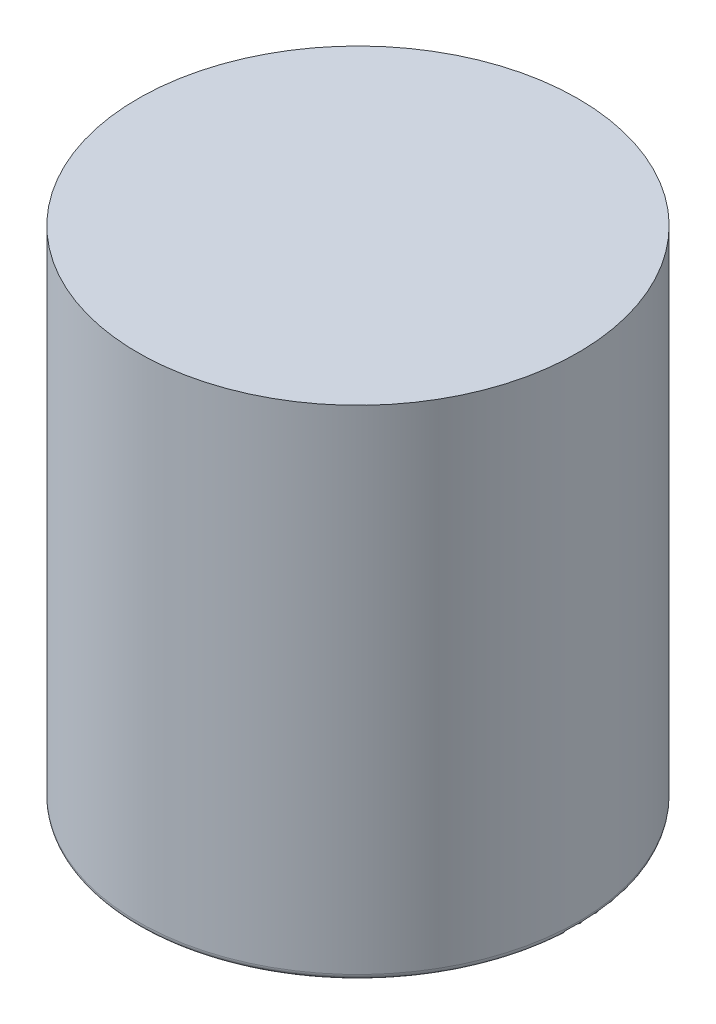
ISO-10303-21;
HEADER;
FILE_DESCRIPTION(('STEP AP214'),'2;1');
FILE_NAME('part.step','',(''),(''),'','','');
FILE_SCHEMA(('AUTOMOTIVE_DESIGN { 1 0 10303 214 1 1 1 1 }'));
ENDSEC;
DATA;
#1=APPLICATION_CONTEXT('core data for automotive mechanical design processes');
#2=APPLICATION_PROTOCOL_DEFINITION('international standard','automotive_design',2000,#1);
#3=PRODUCT_CONTEXT('',#1,'mechanical');
#4=PRODUCT('Part','Part','',(#3));
#5=PRODUCT_RELATED_PRODUCT_CATEGORY('part','',(#4));
#6=PRODUCT_DEFINITION_FORMATION('','',#4);
#7=PRODUCT_DEFINITION_CONTEXT('part definition',#1,'design');
#8=PRODUCT_DEFINITION('design','',#6,#7);
#9=PRODUCT_DEFINITION_SHAPE('','',#8);
#10=(LENGTH_UNIT() NAMED_UNIT(*) SI_UNIT(.MILLI.,.METRE.));
#11=(NAMED_UNIT(*) PLANE_ANGLE_UNIT() SI_UNIT($,.RADIAN.));
#12=(NAMED_UNIT(*) SI_UNIT($,.STERADIAN.) SOLID_ANGLE_UNIT());
#13=UNCERTAINTY_MEASURE_WITH_UNIT(LENGTH_MEASURE(1.E-05),#10,'distance_accuracy_value','');
#14=(GEOMETRIC_REPRESENTATION_CONTEXT(3) GLOBAL_UNCERTAINTY_ASSIGNED_CONTEXT((#13)) GLOBAL_UNIT_ASSIGNED_CONTEXT((#10,
#11,#12)) REPRESENTATION_CONTEXT('',''));
#15=CARTESIAN_POINT('',(0.,0.,0.));
#16=DIRECTION('',(0.,0.,1.));
#17=DIRECTION('',(1.,0.,0.));
#18=AXIS2_PLACEMENT_3D('',#15,#16,#17);
#19=CARTESIAN_POINT('',(7.5,5.90047393364929,0.));
#20=DIRECTION('',(0.,1.,0.));
#21=DIRECTION('',(0.,0.,1.));
#22=AXIS2_PLACEMENT_3D('',#19,#20,#21);
#23=PLANE('',#22);
#24=CARTESIAN_POINT('',(0.,5.90047393364929,0.));
#25=DIRECTION('',(0.,-1.,0.));
#26=DIRECTION('',(0.,0.,-1.));
#27=AXIS2_PLACEMENT_3D('',#24,#25,#26);
#28=CIRCLE('',#27,7.5);
#29=CARTESIAN_POINT('',(0.,5.90047393364929,-7.5));
#30=VERTEX_POINT('',#29);
#31=EDGE_CURVE('E45',#30,#30,#28,.T.);
#32=ORIENTED_EDGE('',*,*,#31,.F.);
#33=EDGE_LOOP('',(#32));
#34=FACE_BOUND('',#33,.T.);
#35=ADVANCED_FACE('F34',(#34),#23,.T.);
#36=CARTESIAN_POINT('',(0.,-19.8403774924026,0.));
#37=DIRECTION('',(0.,-1.,0.));
#38=DIRECTION('',(0.,0.,-1.));
#39=AXIS2_PLACEMENT_3D('',#36,#37,#38);
#40=CYLINDRICAL_SURFACE('',#39,7.5);
#41=CARTESIAN_POINT('',(0.,-10.8995260663507,0.));
#42=DIRECTION('',(0.,-1.,0.));
#43=DIRECTION('',(0.,0.,-1.));
#44=AXIS2_PLACEMENT_3D('',#41,#42,#43);
#45=CIRCLE('',#44,7.5);
#46=CARTESIAN_POINT('',(0.,-10.8995260663507,-7.5));
#47=VERTEX_POINT('',#46);
#48=EDGE_CURVE('E10',#47,#47,#45,.F.);
#49=ORIENTED_EDGE('',*,*,#48,.T.);
#50=EDGE_LOOP('',(#49));
#51=FACE_BOUND('',#50,.T.);
#52=ORIENTED_EDGE('',*,*,#31,.T.);
#53=EDGE_LOOP('',(#52));
#54=FACE_BOUND('',#53,.T.);
#55=ADVANCED_FACE('F83',(#51,#54),#40,.T.);
#56=CARTESIAN_POINT('',(3.5,-11.0995260663507,0.));
#57=DIRECTION('',(0.,-1.,0.));
#58=DIRECTION('',(0.,0.,-1.));
#59=AXIS2_PLACEMENT_3D('',#56,#57,#58);
#60=PLANE('',#59);
#61=CARTESIAN_POINT('',(0.,-11.0995260663507,0.));
#62=DIRECTION('',(0.,-1.,0.));
#63=DIRECTION('',(0.,0.,-1.));
#64=AXIS2_PLACEMENT_3D('',#61,#62,#63);
#65=CIRCLE('',#64,7.3);
#66=CARTESIAN_POINT('',(0.,-11.0995260663507,-7.3));
#67=VERTEX_POINT('',#66);
#68=EDGE_CURVE('E41',#67,#67,#65,.T.);
#69=ORIENTED_EDGE('',*,*,#68,.T.);
#70=EDGE_LOOP('',(#69));
#71=FACE_BOUND('',#70,.T.);
#72=CARTESIAN_POINT('',(0.,-11.0995260663507,5.43971342947618));
#73=DIRECTION('',(0.,-1.,0.));
#74=DIRECTION('',(0.,0.,-1.));
#75=AXIS2_PLACEMENT_3D('',#72,#73,#74);
#76=CIRCLE('',#75,0.79999999999999);
#77=CARTESIAN_POINT('',(0.,-11.0995260663507,4.63971342947619));
#78=VERTEX_POINT('',#77);
#79=EDGE_CURVE('E72',#78,#78,#76,.T.);
#80=ORIENTED_EDGE('',*,*,#79,.F.);
#81=EDGE_LOOP('',(#80));
#82=FACE_BOUND('',#81,.T.);
#83=CARTESIAN_POINT('',(0.,-11.0995260663507,-5.43971342947618));
#84=DIRECTION('',(0.,-1.,0.));
#85=DIRECTION('',(0.,0.,-1.));
#86=AXIS2_PLACEMENT_3D('',#83,#84,#85);
#87=CIRCLE('',#86,0.79999999999999);
#88=CARTESIAN_POINT('',(0.,-11.0995260663507,-6.23971342947617));
#89=VERTEX_POINT('',#88);
#90=EDGE_CURVE('E66',#89,#89,#87,.T.);
#91=ORIENTED_EDGE('',*,*,#90,.F.);
#92=EDGE_LOOP('',(#91));
#93=FACE_BOUND('',#92,.T.);
#94=CARTESIAN_POINT('',(0.,-11.0995260663507,0.));
#95=DIRECTION('',(0.,-1.,0.));
#96=DIRECTION('',(0.,0.,-1.));
#97=AXIS2_PLACEMENT_3D('',#94,#95,#96);
#98=CIRCLE('',#97,3.5);
#99=CARTESIAN_POINT('',(0.,-11.0995260663507,-3.5));
#100=VERTEX_POINT('',#99);
#101=EDGE_CURVE('E49',#100,#100,#98,.T.);
#102=ORIENTED_EDGE('',*,*,#101,.F.);
#103=EDGE_LOOP('',(#102));
#104=FACE_BOUND('',#103,.T.);
#105=ADVANCED_FACE('F79',(#71,#82,#93,#104),#60,.T.);
#106=CARTESIAN_POINT('',(0.,-19.8403774924026,0.));
#107=DIRECTION('',(0.,-1.,0.));
#108=DIRECTION('',(0.,0.,-1.));
#109=AXIS2_PLACEMENT_3D('',#106,#107,#108);
#110=CYLINDRICAL_SURFACE('',#109,3.5);
#111=CARTESIAN_POINT('',(0.,-10.4995260663507,0.));
#112=DIRECTION('',(0.,-1.,0.));
#113=DIRECTION('',(0.,0.,-1.));
#114=AXIS2_PLACEMENT_3D('',#111,#112,#113);
#115=CIRCLE('',#114,3.5);
#116=CARTESIAN_POINT('',(0.,-10.4995260663507,-3.5));
#117=VERTEX_POINT('',#116);
#118=EDGE_CURVE('E54',#117,#117,#115,.T.);
#119=ORIENTED_EDGE('',*,*,#118,.F.);
#120=EDGE_LOOP('',(#119));
#121=FACE_BOUND('',#120,.T.);
#122=ORIENTED_EDGE('',*,*,#101,.T.);
#123=EDGE_LOOP('',(#122));
#124=FACE_BOUND('',#123,.T.);
#125=ADVANCED_FACE('F82',(#121,#124),#110,.F.);
#126=CARTESIAN_POINT('',(3.5,-10.4995260663507,0.));
#127=DIRECTION('',(0.,-1.,0.));
#128=DIRECTION('',(0.,0.,-1.));
#129=AXIS2_PLACEMENT_3D('',#126,#127,#128);
#130=PLANE('',#129);
#131=CARTESIAN_POINT('',(0.,-10.4995260663507,5.43971342947618));
#132=DIRECTION('',(0.,-1.,0.));
#133=DIRECTION('',(0.,0.,-1.));
#134=AXIS2_PLACEMENT_3D('',#131,#132,#133);
#135=CIRCLE('',#134,0.799999999999994);
#136=CARTESIAN_POINT('',(0.,-10.4995260663507,4.63971342947618));
#137=VERTEX_POINT('',#136);
#138=EDGE_CURVE('E69',#137,#137,#135,.T.);
#139=ORIENTED_EDGE('',*,*,#138,.T.);
#140=EDGE_LOOP('',(#139));
#141=FACE_BOUND('',#140,.T.);
#142=CARTESIAN_POINT('',(0.,-10.4995260663507,-5.43971342947618));
#143=DIRECTION('',(0.,-1.,0.));
#144=DIRECTION('',(0.,0.,-1.));
#145=AXIS2_PLACEMENT_3D('',#142,#143,#144);
#146=CIRCLE('',#145,0.799999999999994);
#147=CARTESIAN_POINT('',(0.,-10.4995260663507,-6.23971342947617));
#148=VERTEX_POINT('',#147);
#149=EDGE_CURVE('E63',#148,#148,#146,.T.);
#150=ORIENTED_EDGE('',*,*,#149,.T.);
#151=EDGE_LOOP('',(#150));
#152=FACE_BOUND('',#151,.T.);
#153=CARTESIAN_POINT('',(0.,-10.4995260663507,0.));
#154=DIRECTION('',(0.,-1.,0.));
#155=DIRECTION('',(0.,0.,-1.));
#156=AXIS2_PLACEMENT_3D('',#153,#154,#155);
#157=CIRCLE('',#156,6.9);
#158=CARTESIAN_POINT('',(0.,-10.4995260663507,-6.9));
#159=VERTEX_POINT('',#158);
#160=EDGE_CURVE('E57',#159,#159,#157,.T.);
#161=ORIENTED_EDGE('',*,*,#160,.F.);
#162=EDGE_LOOP('',(#161));
#163=FACE_BOUND('',#162,.T.);
#164=ORIENTED_EDGE('',*,*,#118,.T.);
#165=EDGE_LOOP('',(#164));
#166=FACE_BOUND('',#165,.T.);
#167=ADVANCED_FACE('F90',(#141,#152,#163,#166),#130,.F.);
#168=CARTESIAN_POINT('',(0.,-19.8403774924026,0.));
#169=DIRECTION('',(0.,-1.,0.));
#170=DIRECTION('',(0.,0.,-1.));
#171=AXIS2_PLACEMENT_3D('',#168,#169,#170);
#172=CYLINDRICAL_SURFACE('',#171,6.9);
#173=CARTESIAN_POINT('',(0.,5.30047393364929,0.));
#174=DIRECTION('',(0.,-1.,0.));
#175=DIRECTION('',(0.,0.,-1.));
#176=AXIS2_PLACEMENT_3D('',#173,#174,#175);
#177=CIRCLE('',#176,6.9);
#178=CARTESIAN_POINT('',(0.,5.30047393364929,-6.9));
#179=VERTEX_POINT('',#178);
#180=EDGE_CURVE('E60',#179,#179,#177,.T.);
#181=ORIENTED_EDGE('',*,*,#180,.F.);
#182=EDGE_LOOP('',(#181));
#183=FACE_BOUND('',#182,.T.);
#184=ORIENTED_EDGE('',*,*,#160,.T.);
#185=EDGE_LOOP('',(#184));
#186=FACE_BOUND('',#185,.T.);
#187=ADVANCED_FACE('F96',(#183,#186),#172,.F.);
#188=CARTESIAN_POINT('',(7.5,5.30047393364929,0.));
#189=DIRECTION('',(0.,1.,0.));
#190=DIRECTION('',(0.,0.,1.));
#191=AXIS2_PLACEMENT_3D('',#188,#189,#190);
#192=PLANE('',#191);
#193=ORIENTED_EDGE('',*,*,#180,.T.);
#194=EDGE_LOOP('',(#193));
#195=FACE_BOUND('',#194,.T.);
#196=ADVANCED_FACE('F140',(#195),#192,.F.);
#197=CARTESIAN_POINT('',(0.,-11.0995260663507,-5.43971342947618));
#198=DIRECTION('',(0.,-1.,0.));
#199=DIRECTION('',(0.,0.,-1.));
#200=AXIS2_PLACEMENT_3D('',#197,#198,#199);
#201=CYLINDRICAL_SURFACE('',#200,0.799999999999994);
#202=ORIENTED_EDGE('',*,*,#90,.T.);
#203=EDGE_LOOP('',(#202));
#204=FACE_BOUND('',#203,.T.);
#205=ORIENTED_EDGE('',*,*,#149,.F.);
#206=EDGE_LOOP('',(#205));
#207=FACE_BOUND('',#206,.T.);
#208=ADVANCED_FACE('F133',(#204,#207),#201,.F.);
#209=CARTESIAN_POINT('',(0.,-11.0995260663507,5.43971342947618));
#210=DIRECTION('',(0.,-1.,0.));
#211=DIRECTION('',(0.,0.,-1.));
#212=AXIS2_PLACEMENT_3D('',#209,#210,#211);
#213=CYLINDRICAL_SURFACE('',#212,0.799999999999994);
#214=ORIENTED_EDGE('',*,*,#79,.T.);
#215=EDGE_LOOP('',(#214));
#216=FACE_BOUND('',#215,.T.);
#217=ORIENTED_EDGE('',*,*,#138,.F.);
#218=EDGE_LOOP('',(#217));
#219=FACE_BOUND('',#218,.T.);
#220=ADVANCED_FACE('F76',(#216,#219),#213,.F.);
#221=CARTESIAN_POINT('',(0.,-10.8995260663507,0.));
#222=DIRECTION('',(0.,-1.,0.));
#223=DIRECTION('',(0.,0.,-1.));
#224=AXIS2_PLACEMENT_3D('',#221,#222,#223);
#225=TOROIDAL_SURFACE('',#224,7.3,0.2);
#226=ORIENTED_EDGE('',*,*,#48,.F.);
#227=EDGE_LOOP('',(#226));
#228=FACE_BOUND('',#227,.T.);
#229=ORIENTED_EDGE('',*,*,#68,.F.);
#230=EDGE_LOOP('',(#229));
#231=FACE_BOUND('',#230,.T.);
#232=ADVANCED_FACE('F36',(#228,#231),#225,.T.);
#233=CLOSED_SHELL('',(#35,#55,#105,#125,#167,#187,#196,#208,#220,#232));
#234=MANIFOLD_SOLID_BREP('B2',#233);
#235=ADVANCED_BREP_SHAPE_REPRESENTATION('',(#18,#234),#14);
#236=SHAPE_DEFINITION_REPRESENTATION(#9,#235);
ENDSEC;
END-ISO-10303-21;
